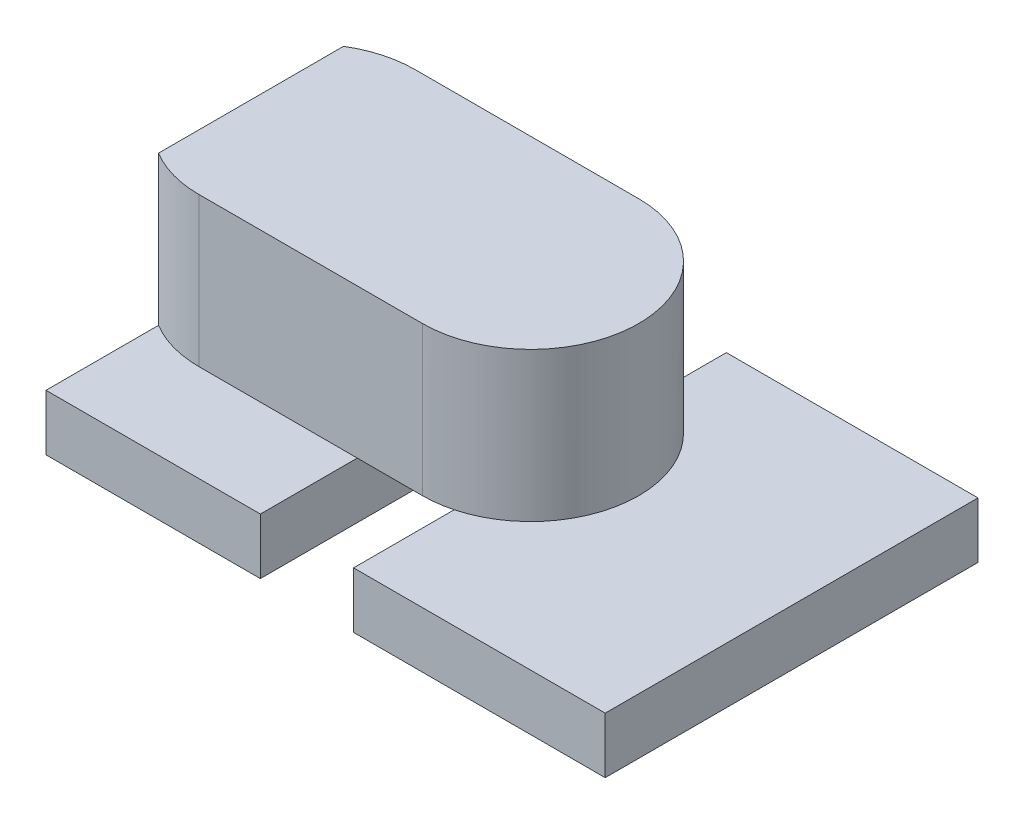
ISO-10303-21;
HEADER;
FILE_DESCRIPTION(('STEP AP214'),'2;1');
FILE_NAME('part.step','',(''),(''),'','','');
FILE_SCHEMA(('AUTOMOTIVE_DESIGN { 1 0 10303 214 1 1 1 1 }'));
ENDSEC;
DATA;
#1=APPLICATION_CONTEXT('core data for automotive mechanical design processes');
#2=APPLICATION_PROTOCOL_DEFINITION('international standard','automotive_design',2000,#1);
#3=PRODUCT_CONTEXT('',#1,'mechanical');
#4=PRODUCT('Part','Part','',(#3));
#5=PRODUCT_RELATED_PRODUCT_CATEGORY('part','',(#4));
#6=PRODUCT_DEFINITION_FORMATION('','',#4);
#7=PRODUCT_DEFINITION_CONTEXT('part definition',#1,'design');
#8=PRODUCT_DEFINITION('design','',#6,#7);
#9=PRODUCT_DEFINITION_SHAPE('','',#8);
#10=(LENGTH_UNIT() NAMED_UNIT(*) SI_UNIT(.MILLI.,.METRE.));
#11=(NAMED_UNIT(*) PLANE_ANGLE_UNIT() SI_UNIT($,.RADIAN.));
#12=(NAMED_UNIT(*) SI_UNIT($,.STERADIAN.) SOLID_ANGLE_UNIT());
#13=UNCERTAINTY_MEASURE_WITH_UNIT(LENGTH_MEASURE(1.E-05),#10,'distance_accuracy_value','');
#14=(GEOMETRIC_REPRESENTATION_CONTEXT(3) GLOBAL_UNCERTAINTY_ASSIGNED_CONTEXT((#13)) GLOBAL_UNIT_ASSIGNED_CONTEXT((#10,
#11,#12)) REPRESENTATION_CONTEXT('',''));
#15=CARTESIAN_POINT('',(0.,0.,0.));
#16=DIRECTION('',(0.,0.,1.));
#17=DIRECTION('',(1.,0.,0.));
#18=AXIS2_PLACEMENT_3D('',#15,#16,#17);
#19=CARTESIAN_POINT('',(-7.5,1.5,-5.));
#20=DIRECTION('',(0.,0.,1.));
#21=DIRECTION('',(1.,0.,0.));
#22=AXIS2_PLACEMENT_3D('',#19,#20,#21);
#23=PLANE('',#22);
#24=DIRECTION('',(-1.,0.,0.));
#25=VECTOR('',#24,1.);
#26=CARTESIAN_POINT('',(-7.5,1.5,-5.));
#27=LINE('',#26,#25);
#28=CARTESIAN_POINT('',(-1.75,1.5,-5.));
#29=VERTEX_POINT('',#28);
#30=CARTESIAN_POINT('',(-7.5,1.5,-5.));
#31=VERTEX_POINT('',#30);
#32=EDGE_CURVE('E169',#29,#31,#27,.T.);
#33=ORIENTED_EDGE('',*,*,#32,.F.);
#34=DIRECTION('',(0.,-1.,0.));
#35=VECTOR('',#34,1.);
#36=CARTESIAN_POINT('',(-1.75,1.5,-5.));
#37=LINE('',#36,#35);
#38=CARTESIAN_POINT('',(-1.75,0.,-5.));
#39=VERTEX_POINT('',#38);
#40=EDGE_CURVE('E154',#29,#39,#37,.T.);
#41=ORIENTED_EDGE('',*,*,#40,.T.);
#42=DIRECTION('',(-1.,0.,0.));
#43=VECTOR('',#42,1.);
#44=CARTESIAN_POINT('',(-7.5,0.,-5.));
#45=LINE('',#44,#43);
#46=CARTESIAN_POINT('',(-7.5,0.,-5.));
#47=VERTEX_POINT('',#46);
#48=EDGE_CURVE('E203',#39,#47,#45,.T.);
#49=ORIENTED_EDGE('',*,*,#48,.T.);
#50=DIRECTION('',(0.,-1.,0.));
#51=VECTOR('',#50,1.);
#52=CARTESIAN_POINT('',(-7.5,1.5,-5.));
#53=LINE('',#52,#51);
#54=EDGE_CURVE('E48',#31,#47,#53,.T.);
#55=ORIENTED_EDGE('',*,*,#54,.F.);
#56=EDGE_LOOP('',(#33,#41,#49,#55));
#57=FACE_BOUND('',#56,.T.);
#58=ADVANCED_FACE('F39',(#57),#23,.F.);
#59=CARTESIAN_POINT('',(-7.5,1.5,5.));
#60=DIRECTION('',(0.,0.,-1.));
#61=DIRECTION('',(-1.,0.,0.));
#62=AXIS2_PLACEMENT_3D('',#59,#60,#61);
#63=PLANE('',#62);
#64=DIRECTION('',(1.,0.,0.));
#65=VECTOR('',#64,1.);
#66=CARTESIAN_POINT('',(-7.5,0.,5.));
#67=LINE('',#66,#65);
#68=CARTESIAN_POINT('',(-7.5,0.,5.));
#69=VERTEX_POINT('',#68);
#70=CARTESIAN_POINT('',(-1.75,0.,5.));
#71=VERTEX_POINT('',#70);
#72=EDGE_CURVE('E186',#69,#71,#67,.T.);
#73=ORIENTED_EDGE('',*,*,#72,.T.);
#74=DIRECTION('',(0.,-1.,0.));
#75=VECTOR('',#74,1.);
#76=CARTESIAN_POINT('',(-1.75,1.5,5.));
#77=LINE('',#76,#75);
#78=CARTESIAN_POINT('',(-1.75,1.5,5.));
#79=VERTEX_POINT('',#78);
#80=EDGE_CURVE('E235',#79,#71,#77,.T.);
#81=ORIENTED_EDGE('',*,*,#80,.F.);
#82=DIRECTION('',(1.,0.,0.));
#83=VECTOR('',#82,1.);
#84=CARTESIAN_POINT('',(-7.5,1.5,5.));
#85=LINE('',#84,#83);
#86=CARTESIAN_POINT('',(-7.5,1.5,5.));
#87=VERTEX_POINT('',#86);
#88=EDGE_CURVE('E194',#87,#79,#85,.T.);
#89=ORIENTED_EDGE('',*,*,#88,.F.);
#90=DIRECTION('',(0.,-1.,0.));
#91=VECTOR('',#90,1.);
#92=CARTESIAN_POINT('',(-7.5,1.5,5.));
#93=LINE('',#92,#91);
#94=EDGE_CURVE('E219',#87,#69,#93,.T.);
#95=ORIENTED_EDGE('',*,*,#94,.T.);
#96=EDGE_LOOP('',(#73,#81,#89,#95));
#97=FACE_BOUND('',#96,.T.);
#98=ADVANCED_FACE('F233',(#97),#63,.F.);
#99=CARTESIAN_POINT('',(0.,1.5,0.));
#100=DIRECTION('',(0.,-1.,0.));
#101=DIRECTION('',(0.,0.,-1.));
#102=AXIS2_PLACEMENT_3D('',#99,#100,#101);
#103=PLANE('',#102);
#104=DIRECTION('',(-1.,0.,0.));
#105=VECTOR('',#104,1.);
#106=CARTESIAN_POINT('',(-6.,1.5,-3.4));
#107=LINE('',#106,#105);
#108=CARTESIAN_POINT('',(-1.75,1.5,-3.4));
#109=VERTEX_POINT('',#108);
#110=CARTESIAN_POINT('',(-6.,1.5,-3.4));
#111=VERTEX_POINT('',#110);
#112=EDGE_CURVE('E63',#109,#111,#107,.T.);
#113=ORIENTED_EDGE('',*,*,#112,.F.);
#114=DIRECTION('',(0.,0.,-1.));
#115=VECTOR('',#114,1.);
#116=CARTESIAN_POINT('',(-1.75,1.5,-5.));
#117=LINE('',#116,#115);
#118=EDGE_CURVE('E157',#109,#29,#117,.T.);
#119=ORIENTED_EDGE('',*,*,#118,.T.);
#120=ORIENTED_EDGE('',*,*,#32,.T.);
#121=DIRECTION('',(0.,0.,1.));
#122=VECTOR('',#121,1.);
#123=CARTESIAN_POINT('',(-7.5,1.5,5.));
#124=LINE('',#123,#122);
#125=CARTESIAN_POINT('',(-7.5,1.5,-2.98193472919817));
#126=VERTEX_POINT('',#125);
#127=EDGE_CURVE('E190',#31,#126,#124,.T.);
#128=ORIENTED_EDGE('',*,*,#127,.T.);
#129=CARTESIAN_POINT('',(-6.,1.5,-0.5));
#130=DIRECTION('',(0.,1.,0.));
#131=DIRECTION('',(0.,0.,1.));
#132=AXIS2_PLACEMENT_3D('',#129,#130,#131);
#133=CIRCLE('',#132,2.9);
#134=EDGE_CURVE('E285',#111,#126,#133,.T.);
#135=ORIENTED_EDGE('',*,*,#134,.F.);
#136=EDGE_LOOP('',(#113,#119,#120,#128,#135));
#137=FACE_BOUND('',#136,.T.);
#138=ADVANCED_FACE('F168',(#137),#103,.F.);
#139=ORIENTED_EDGE('',*,*,#88,.T.);
#140=CARTESIAN_POINT('',(-1.75,1.5,2.4));
#141=VERTEX_POINT('',#140);
#142=EDGE_CURVE('E174',#79,#141,#117,.T.);
#143=ORIENTED_EDGE('',*,*,#142,.T.);
#144=DIRECTION('',(1.,0.,0.));
#145=VECTOR('',#144,1.);
#146=CARTESIAN_POINT('',(-6.,1.5,2.4));
#147=LINE('',#146,#145);
#148=CARTESIAN_POINT('',(-6.,1.5,2.4));
#149=VERTEX_POINT('',#148);
#150=EDGE_CURVE('E279',#149,#141,#147,.T.);
#151=ORIENTED_EDGE('',*,*,#150,.F.);
#152=CARTESIAN_POINT('',(-6.,1.5,-0.5));
#153=DIRECTION('',(0.,1.,0.));
#154=DIRECTION('',(0.,0.,1.));
#155=AXIS2_PLACEMENT_3D('',#152,#153,#154);
#156=CIRCLE('',#155,2.9);
#157=CARTESIAN_POINT('',(-7.5,1.5,1.98193472919817));
#158=VERTEX_POINT('',#157);
#159=EDGE_CURVE('E247',#158,#149,#156,.T.);
#160=ORIENTED_EDGE('',*,*,#159,.F.);
#161=EDGE_CURVE('E184',#158,#87,#124,.T.);
#162=ORIENTED_EDGE('',*,*,#161,.T.);
#163=EDGE_LOOP('',(#139,#143,#151,#160,#162));
#164=FACE_BOUND('',#163,.T.);
#165=ADVANCED_FACE('F353',(#164),#103,.F.);
#166=CARTESIAN_POINT('',(0.,0.,0.));
#167=DIRECTION('',(0.,-1.,0.));
#168=DIRECTION('',(0.,0.,-1.));
#169=AXIS2_PLACEMENT_3D('',#166,#167,#168);
#170=PLANE('',#169);
#171=DIRECTION('',(0.,0.,-1.));
#172=VECTOR('',#171,1.);
#173=CARTESIAN_POINT('',(-1.75,0.,-5.));
#174=LINE('',#173,#172);
#175=EDGE_CURVE('E159',#71,#39,#174,.T.);
#176=ORIENTED_EDGE('',*,*,#175,.F.);
#177=ORIENTED_EDGE('',*,*,#72,.F.);
#178=DIRECTION('',(0.,0.,1.));
#179=VECTOR('',#178,1.);
#180=CARTESIAN_POINT('',(-7.5,0.,5.));
#181=LINE('',#180,#179);
#182=EDGE_CURVE('E209',#47,#69,#181,.T.);
#183=ORIENTED_EDGE('',*,*,#182,.F.);
#184=ORIENTED_EDGE('',*,*,#48,.F.);
#185=EDGE_LOOP('',(#176,#177,#183,#184));
#186=FACE_BOUND('',#185,.T.);
#187=ADVANCED_FACE('F230',(#186),#170,.T.);
#188=CARTESIAN_POINT('',(7.5,1.5,5.));
#189=DIRECTION('',(-1.,0.,0.));
#190=DIRECTION('',(0.,0.,1.));
#191=AXIS2_PLACEMENT_3D('',#188,#189,#190);
#192=PLANE('',#191);
#193=DIRECTION('',(0.,0.,-1.));
#194=VECTOR('',#193,1.);
#195=CARTESIAN_POINT('',(7.5,0.,5.));
#196=LINE('',#195,#194);
#197=CARTESIAN_POINT('',(7.5,0.,5.));
#198=VERTEX_POINT('',#197);
#199=CARTESIAN_POINT('',(7.5,0.,-5.));
#200=VERTEX_POINT('',#199);
#201=EDGE_CURVE('E199',#198,#200,#196,.T.);
#202=ORIENTED_EDGE('',*,*,#201,.T.);
#203=DIRECTION('',(0.,-1.,0.));
#204=VECTOR('',#203,1.);
#205=CARTESIAN_POINT('',(7.5,1.5,-5.));
#206=LINE('',#205,#204);
#207=CARTESIAN_POINT('',(7.5,1.5,-5.));
#208=VERTEX_POINT('',#207);
#209=EDGE_CURVE('E11',#208,#200,#206,.T.);
#210=ORIENTED_EDGE('',*,*,#209,.F.);
#211=DIRECTION('',(0.,0.,-1.));
#212=VECTOR('',#211,1.);
#213=CARTESIAN_POINT('',(7.5,1.5,5.));
#214=LINE('',#213,#212);
#215=CARTESIAN_POINT('',(7.5,1.5,5.));
#216=VERTEX_POINT('',#215);
#217=EDGE_CURVE('E179',#216,#208,#214,.T.);
#218=ORIENTED_EDGE('',*,*,#217,.F.);
#219=DIRECTION('',(0.,-1.,0.));
#220=VECTOR('',#219,1.);
#221=CARTESIAN_POINT('',(7.5,1.5,5.));
#222=LINE('',#221,#220);
#223=EDGE_CURVE('E198',#216,#198,#222,.T.);
#224=ORIENTED_EDGE('',*,*,#223,.T.);
#225=EDGE_LOOP('',(#202,#210,#218,#224));
#226=FACE_BOUND('',#225,.T.);
#227=ADVANCED_FACE('F41',(#226),#192,.F.);
#228=CARTESIAN_POINT('',(0.75,0.,-5.));
#229=VERTEX_POINT('',#228);
#230=EDGE_CURVE('E205',#200,#229,#45,.T.);
#231=ORIENTED_EDGE('',*,*,#230,.T.);
#232=DIRECTION('',(0.,-1.,0.));
#233=VECTOR('',#232,1.);
#234=CARTESIAN_POINT('',(0.75,1.5,-5.));
#235=LINE('',#234,#233);
#236=CARTESIAN_POINT('',(0.75,1.5,-5.));
#237=VERTEX_POINT('',#236);
#238=EDGE_CURVE('E164',#237,#229,#235,.T.);
#239=ORIENTED_EDGE('',*,*,#238,.F.);
#240=EDGE_CURVE('E178',#208,#237,#27,.T.);
#241=ORIENTED_EDGE('',*,*,#240,.F.);
#242=ORIENTED_EDGE('',*,*,#209,.T.);
#243=EDGE_LOOP('',(#231,#239,#241,#242));
#244=FACE_BOUND('',#243,.T.);
#245=ADVANCED_FACE('F366',(#244),#23,.F.);
#246=CARTESIAN_POINT('',(-7.5,1.5,5.));
#247=DIRECTION('',(1.,0.,0.));
#248=DIRECTION('',(0.,0.,-1.));
#249=AXIS2_PLACEMENT_3D('',#246,#247,#248);
#250=PLANE('',#249);
#251=ORIENTED_EDGE('',*,*,#182,.T.);
#252=ORIENTED_EDGE('',*,*,#94,.F.);
#253=ORIENTED_EDGE('',*,*,#161,.F.);
#254=DIRECTION('',(0.,-1.,0.));
#255=VECTOR('',#254,1.);
#256=CARTESIAN_POINT('',(-7.5,5.5,1.98193472919817));
#257=LINE('',#256,#255);
#258=CARTESIAN_POINT('',(-7.5,5.5,1.98193472919817));
#259=VERTEX_POINT('',#258);
#260=EDGE_CURVE('E239',#259,#158,#257,.T.);
#261=ORIENTED_EDGE('',*,*,#260,.F.);
#262=DIRECTION('',(0.,0.,1.));
#263=VECTOR('',#262,1.);
#264=CARTESIAN_POINT('',(-7.5,5.5,-2.98193472919817));
#265=LINE('',#264,#263);
#266=CARTESIAN_POINT('',(-7.5,5.5,-2.98193472919817));
#267=VERTEX_POINT('',#266);
#268=EDGE_CURVE('E300',#267,#259,#265,.T.);
#269=ORIENTED_EDGE('',*,*,#268,.F.);
#270=DIRECTION('',(0.,-1.,0.));
#271=VECTOR('',#270,1.);
#272=CARTESIAN_POINT('',(-7.5,5.5,-2.98193472919817));
#273=LINE('',#272,#271);
#274=EDGE_CURVE('E204',#267,#126,#273,.T.);
#275=ORIENTED_EDGE('',*,*,#274,.T.);
#276=ORIENTED_EDGE('',*,*,#127,.F.);
#277=ORIENTED_EDGE('',*,*,#54,.T.);
#278=EDGE_LOOP('',(#251,#252,#253,#261,#269,#275,#276,#277));
#279=FACE_BOUND('',#278,.T.);
#280=ADVANCED_FACE('F225',(#279),#250,.F.);
#281=CARTESIAN_POINT('',(0.75,1.5,5.));
#282=VERTEX_POINT('',#281);
#283=EDGE_CURVE('E193',#282,#216,#85,.T.);
#284=ORIENTED_EDGE('',*,*,#283,.F.);
#285=DIRECTION('',(0.,-1.,0.));
#286=VECTOR('',#285,1.);
#287=CARTESIAN_POINT('',(0.75,1.5,5.));
#288=LINE('',#287,#286);
#289=CARTESIAN_POINT('',(0.75,0.,5.));
#290=VERTEX_POINT('',#289);
#291=EDGE_CURVE('E313',#282,#290,#288,.T.);
#292=ORIENTED_EDGE('',*,*,#291,.T.);
#293=EDGE_CURVE('E212',#290,#198,#67,.T.);
#294=ORIENTED_EDGE('',*,*,#293,.T.);
#295=ORIENTED_EDGE('',*,*,#223,.F.);
#296=EDGE_LOOP('',(#284,#292,#294,#295));
#297=FACE_BOUND('',#296,.T.);
#298=ADVANCED_FACE('F364',(#297),#63,.F.);
#299=ORIENTED_EDGE('',*,*,#240,.T.);
#300=DIRECTION('',(0.,0.,1.));
#301=VECTOR('',#300,1.);
#302=CARTESIAN_POINT('',(0.75,1.5,-5.));
#303=LINE('',#302,#301);
#304=CARTESIAN_POINT('',(0.75,1.5,-3.30133896556629));
#305=VERTEX_POINT('',#304);
#306=EDGE_CURVE('E165',#237,#305,#303,.T.);
#307=ORIENTED_EDGE('',*,*,#306,.T.);
#308=CARTESIAN_POINT('',(0.,1.5,-0.5));
#309=DIRECTION('',(0.,1.,0.));
#310=DIRECTION('',(0.,0.,1.));
#311=AXIS2_PLACEMENT_3D('',#308,#309,#310);
#312=CIRCLE('',#311,2.9);
#313=CARTESIAN_POINT('',(0.75,1.5,2.30133896556629));
#314=VERTEX_POINT('',#313);
#315=EDGE_CURVE('E278',#314,#305,#312,.T.);
#316=ORIENTED_EDGE('',*,*,#315,.F.);
#317=EDGE_CURVE('E326',#314,#282,#303,.T.);
#318=ORIENTED_EDGE('',*,*,#317,.T.);
#319=ORIENTED_EDGE('',*,*,#283,.T.);
#320=ORIENTED_EDGE('',*,*,#217,.T.);
#321=EDGE_LOOP('',(#299,#307,#316,#318,#319,#320));
#322=FACE_BOUND('',#321,.T.);
#323=ADVANCED_FACE('F343',(#322),#103,.F.);
#324=DIRECTION('',(0.,0.,1.));
#325=VECTOR('',#324,1.);
#326=CARTESIAN_POINT('',(0.75,0.,-5.));
#327=LINE('',#326,#325);
#328=EDGE_CURVE('E172',#229,#290,#327,.T.);
#329=ORIENTED_EDGE('',*,*,#328,.F.);
#330=ORIENTED_EDGE('',*,*,#230,.F.);
#331=ORIENTED_EDGE('',*,*,#201,.F.);
#332=ORIENTED_EDGE('',*,*,#293,.F.);
#333=EDGE_LOOP('',(#329,#330,#331,#332));
#334=FACE_BOUND('',#333,.T.);
#335=ADVANCED_FACE('F361',(#334),#170,.T.);
#336=CARTESIAN_POINT('',(-6.,5.5,-0.5));
#337=DIRECTION('',(0.,-1.,0.));
#338=DIRECTION('',(0.,0.,-1.));
#339=AXIS2_PLACEMENT_3D('',#336,#337,#338);
#340=CYLINDRICAL_SURFACE('',#339,2.9);
#341=ORIENTED_EDGE('',*,*,#134,.T.);
#342=ORIENTED_EDGE('',*,*,#274,.F.);
#343=CARTESIAN_POINT('',(-6.,5.5,-0.5));
#344=DIRECTION('',(0.,1.,0.));
#345=DIRECTION('',(0.,0.,1.));
#346=AXIS2_PLACEMENT_3D('',#343,#344,#345);
#347=CIRCLE('',#346,2.9);
#348=CARTESIAN_POINT('',(-6.,5.5,-3.4));
#349=VERTEX_POINT('',#348);
#350=EDGE_CURVE('E273',#349,#267,#347,.T.);
#351=ORIENTED_EDGE('',*,*,#350,.F.);
#352=DIRECTION('',(0.,-1.,0.));
#353=VECTOR('',#352,1.);
#354=CARTESIAN_POINT('',(-6.,5.5,-3.4));
#355=LINE('',#354,#353);
#356=EDGE_CURVE('E265',#349,#111,#355,.T.);
#357=ORIENTED_EDGE('',*,*,#356,.T.);
#358=EDGE_LOOP('',(#341,#342,#351,#357));
#359=FACE_BOUND('',#358,.T.);
#360=ADVANCED_FACE('F396',(#359),#340,.T.);
#361=CARTESIAN_POINT('',(-6.,5.5,-0.5));
#362=DIRECTION('',(0.,-1.,0.));
#363=DIRECTION('',(0.,0.,-1.));
#364=AXIS2_PLACEMENT_3D('',#361,#362,#363);
#365=CYLINDRICAL_SURFACE('',#364,2.9);
#366=ORIENTED_EDGE('',*,*,#159,.T.);
#367=DIRECTION('',(0.,-1.,0.));
#368=VECTOR('',#367,1.);
#369=CARTESIAN_POINT('',(-6.,5.5,2.4));
#370=LINE('',#369,#368);
#371=CARTESIAN_POINT('',(-6.,5.5,2.4));
#372=VERTEX_POINT('',#371);
#373=EDGE_CURVE('E251',#372,#149,#370,.T.);
#374=ORIENTED_EDGE('',*,*,#373,.F.);
#375=CARTESIAN_POINT('',(-6.,5.5,-0.5));
#376=DIRECTION('',(0.,1.,0.));
#377=DIRECTION('',(0.,0.,1.));
#378=AXIS2_PLACEMENT_3D('',#375,#376,#377);
#379=CIRCLE('',#378,2.9);
#380=EDGE_CURVE('E249',#259,#372,#379,.T.);
#381=ORIENTED_EDGE('',*,*,#380,.F.);
#382=ORIENTED_EDGE('',*,*,#260,.T.);
#383=EDGE_LOOP('',(#366,#374,#381,#382));
#384=FACE_BOUND('',#383,.T.);
#385=ADVANCED_FACE('F245',(#384),#365,.T.);
#386=CARTESIAN_POINT('',(-6.,5.5,2.4));
#387=DIRECTION('',(0.,0.,-1.));
#388=DIRECTION('',(-1.,0.,0.));
#389=AXIS2_PLACEMENT_3D('',#386,#387,#388);
#390=PLANE('',#389);
#391=ORIENTED_EDGE('',*,*,#150,.T.);
#392=DIRECTION('',(-1.,0.,0.));
#393=VECTOR('',#392,1.);
#394=CARTESIAN_POINT('',(-6.,1.5,2.4));
#395=LINE('',#394,#393);
#396=CARTESIAN_POINT('',(0.,1.5,2.4));
#397=VERTEX_POINT('',#396);
#398=EDGE_CURVE('E289',#397,#141,#395,.T.);
#399=ORIENTED_EDGE('',*,*,#398,.F.);
#400=DIRECTION('',(0.,-1.,0.));
#401=VECTOR('',#400,1.);
#402=CARTESIAN_POINT('',(0.,5.5,2.4));
#403=LINE('',#402,#401);
#404=CARTESIAN_POINT('',(0.,5.5,2.4));
#405=VERTEX_POINT('',#404);
#406=EDGE_CURVE('E255',#405,#397,#403,.T.);
#407=ORIENTED_EDGE('',*,*,#406,.F.);
#408=DIRECTION('',(1.,0.,0.));
#409=VECTOR('',#408,1.);
#410=CARTESIAN_POINT('',(-6.,5.5,2.4));
#411=LINE('',#410,#409);
#412=EDGE_CURVE('E295',#372,#405,#411,.T.);
#413=ORIENTED_EDGE('',*,*,#412,.F.);
#414=ORIENTED_EDGE('',*,*,#373,.T.);
#415=EDGE_LOOP('',(#391,#399,#407,#413,#414));
#416=FACE_BOUND('',#415,.T.);
#417=ADVANCED_FACE('F352',(#416),#390,.F.);
#418=CARTESIAN_POINT('',(0.,5.5,-0.5));
#419=DIRECTION('',(0.,-1.,0.));
#420=DIRECTION('',(0.,0.,-1.));
#421=AXIS2_PLACEMENT_3D('',#418,#419,#420);
#422=CYLINDRICAL_SURFACE('',#421,2.9);
#423=EDGE_CURVE('E274',#397,#314,#312,.T.);
#424=ORIENTED_EDGE('',*,*,#423,.T.);
#425=ORIENTED_EDGE('',*,*,#315,.T.);
#426=CARTESIAN_POINT('',(0.,1.5,-0.5));
#427=DIRECTION('',(0.,-1.,0.));
#428=DIRECTION('',(0.,0.,-1.));
#429=AXIS2_PLACEMENT_3D('',#426,#427,#428);
#430=CIRCLE('',#429,2.9);
#431=CARTESIAN_POINT('',(0.,1.5,-3.4));
#432=VERTEX_POINT('',#431);
#433=EDGE_CURVE('E308',#432,#305,#430,.T.);
#434=ORIENTED_EDGE('',*,*,#433,.F.);
#435=DIRECTION('',(0.,-1.,0.));
#436=VECTOR('',#435,1.);
#437=CARTESIAN_POINT('',(0.,5.5,-3.4));
#438=LINE('',#437,#436);
#439=CARTESIAN_POINT('',(0.,5.5,-3.4));
#440=VERTEX_POINT('',#439);
#441=EDGE_CURVE('E261',#440,#432,#438,.T.);
#442=ORIENTED_EDGE('',*,*,#441,.F.);
#443=CARTESIAN_POINT('',(0.,5.5,-0.5));
#444=DIRECTION('',(0.,1.,0.));
#445=DIRECTION('',(0.,0.,1.));
#446=AXIS2_PLACEMENT_3D('',#443,#444,#445);
#447=CIRCLE('',#446,2.9);
#448=EDGE_CURVE('E292',#405,#440,#447,.T.);
#449=ORIENTED_EDGE('',*,*,#448,.F.);
#450=ORIENTED_EDGE('',*,*,#406,.T.);
#451=EDGE_LOOP('',(#424,#425,#434,#442,#449,#450));
#452=FACE_BOUND('',#451,.T.);
#453=ADVANCED_FACE('F346',(#452),#422,.T.);
#454=CARTESIAN_POINT('',(-6.,5.5,-3.4));
#455=DIRECTION('',(0.,0.,1.));
#456=DIRECTION('',(1.,0.,0.));
#457=AXIS2_PLACEMENT_3D('',#454,#455,#456);
#458=PLANE('',#457);
#459=EDGE_CURVE('E270',#432,#109,#107,.T.);
#460=ORIENTED_EDGE('',*,*,#459,.T.);
#461=ORIENTED_EDGE('',*,*,#112,.T.);
#462=ORIENTED_EDGE('',*,*,#356,.F.);
#463=DIRECTION('',(-1.,0.,0.));
#464=VECTOR('',#463,1.);
#465=CARTESIAN_POINT('',(-6.,5.5,-3.4));
#466=LINE('',#465,#464);
#467=EDGE_CURVE('E269',#440,#349,#466,.T.);
#468=ORIENTED_EDGE('',*,*,#467,.F.);
#469=ORIENTED_EDGE('',*,*,#441,.T.);
#470=EDGE_LOOP('',(#460,#461,#462,#468,#469));
#471=FACE_BOUND('',#470,.T.);
#472=ADVANCED_FACE('F410',(#471),#458,.F.);
#473=CARTESIAN_POINT('',(-6.,5.5,-0.5));
#474=DIRECTION('',(0.,1.,0.));
#475=DIRECTION('',(0.,0.,1.));
#476=AXIS2_PLACEMENT_3D('',#473,#474,#475);
#477=PLANE('',#476);
#478=ORIENTED_EDGE('',*,*,#350,.T.);
#479=ORIENTED_EDGE('',*,*,#268,.T.);
#480=ORIENTED_EDGE('',*,*,#380,.T.);
#481=ORIENTED_EDGE('',*,*,#412,.T.);
#482=ORIENTED_EDGE('',*,*,#448,.T.);
#483=ORIENTED_EDGE('',*,*,#467,.T.);
#484=EDGE_LOOP('',(#478,#479,#480,#481,#482,#483));
#485=FACE_BOUND('',#484,.T.);
#486=ADVANCED_FACE('F413',(#485),#477,.T.);
#487=CARTESIAN_POINT('',(0.,1.5,0.));
#488=DIRECTION('',(0.,-1.,0.));
#489=DIRECTION('',(0.,0.,-1.));
#490=AXIS2_PLACEMENT_3D('',#487,#488,#489);
#491=PLANE('',#490);
#492=ORIENTED_EDGE('',*,*,#398,.T.);
#493=EDGE_CURVE('E55',#141,#109,#117,.T.);
#494=ORIENTED_EDGE('',*,*,#493,.T.);
#495=ORIENTED_EDGE('',*,*,#459,.F.);
#496=ORIENTED_EDGE('',*,*,#433,.T.);
#497=EDGE_CURVE('E325',#305,#314,#303,.T.);
#498=ORIENTED_EDGE('',*,*,#497,.T.);
#499=ORIENTED_EDGE('',*,*,#423,.F.);
#500=EDGE_LOOP('',(#492,#494,#495,#496,#498,#499));
#501=FACE_BOUND('',#500,.T.);
#502=ADVANCED_FACE('F338',(#501),#491,.T.);
#503=CARTESIAN_POINT('',(-1.75,1.5,-5.));
#504=DIRECTION('',(-1.,0.,0.));
#505=DIRECTION('',(0.,0.,1.));
#506=AXIS2_PLACEMENT_3D('',#503,#504,#505);
#507=PLANE('',#506);
#508=ORIENTED_EDGE('',*,*,#175,.T.);
#509=ORIENTED_EDGE('',*,*,#40,.F.);
#510=ORIENTED_EDGE('',*,*,#118,.F.);
#511=ORIENTED_EDGE('',*,*,#493,.F.);
#512=ORIENTED_EDGE('',*,*,#142,.F.);
#513=ORIENTED_EDGE('',*,*,#80,.T.);
#514=EDGE_LOOP('',(#508,#509,#510,#511,#512,#513));
#515=FACE_BOUND('',#514,.T.);
#516=ADVANCED_FACE('F156',(#515),#507,.F.);
#517=CARTESIAN_POINT('',(0.75,1.5,-5.));
#518=DIRECTION('',(1.,0.,0.));
#519=DIRECTION('',(0.,0.,-1.));
#520=AXIS2_PLACEMENT_3D('',#517,#518,#519);
#521=PLANE('',#520);
#522=ORIENTED_EDGE('',*,*,#328,.T.);
#523=ORIENTED_EDGE('',*,*,#291,.F.);
#524=ORIENTED_EDGE('',*,*,#317,.F.);
#525=ORIENTED_EDGE('',*,*,#497,.F.);
#526=ORIENTED_EDGE('',*,*,#306,.F.);
#527=ORIENTED_EDGE('',*,*,#238,.T.);
#528=EDGE_LOOP('',(#522,#523,#524,#525,#526,#527));
#529=FACE_BOUND('',#528,.T.);
#530=ADVANCED_FACE('F385',(#529),#521,.F.);
#531=CLOSED_SHELL('',(#58,#98,#138,#165,#187,#227,#245,#280,#298,#323,#335,#360,#385,#417,#453,
#472,#486,#502,#516,#530));
#532=MANIFOLD_SOLID_BREP('B2',#531);
#533=ADVANCED_BREP_SHAPE_REPRESENTATION('',(#18,#532),#14);
#534=SHAPE_DEFINITION_REPRESENTATION(#9,#533);
ENDSEC;
END-ISO-10303-21;
